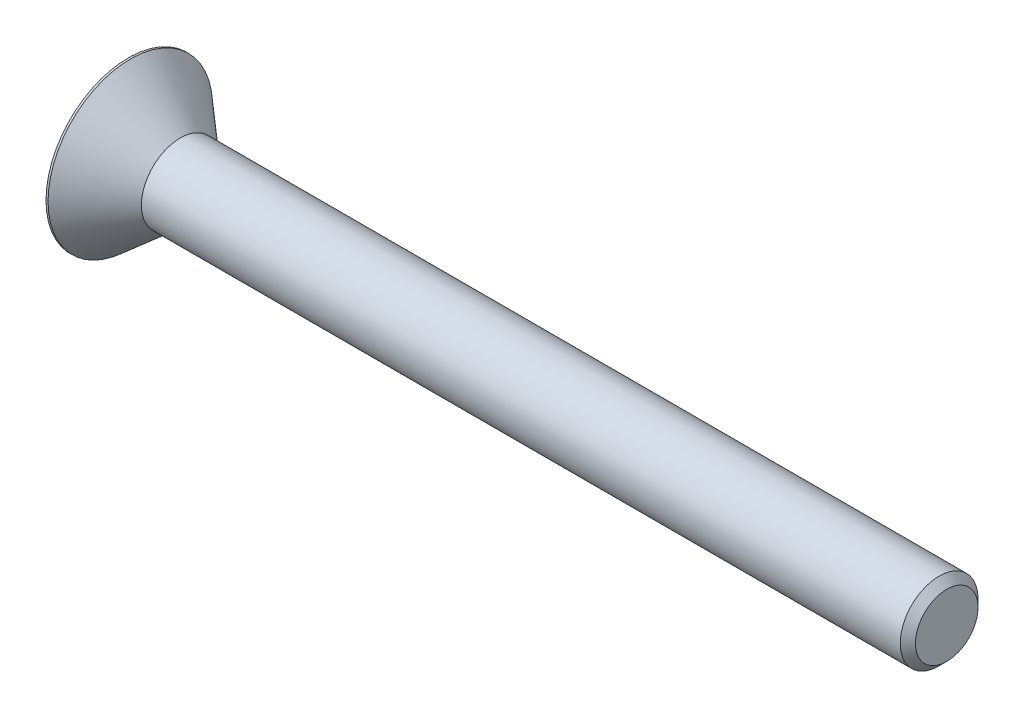
ISO-10303-21;
HEADER;
FILE_DESCRIPTION(('STEP AP214'),'2;1');
FILE_NAME('part.step','',(''),(''),'','','');
FILE_SCHEMA(('AUTOMOTIVE_DESIGN { 1 0 10303 214 1 1 1 1 }'));
ENDSEC;
DATA;
#1=APPLICATION_CONTEXT('core data for automotive mechanical design processes');
#2=APPLICATION_PROTOCOL_DEFINITION('international standard','automotive_design',2000,#1);
#3=PRODUCT_CONTEXT('',#1,'mechanical');
#4=PRODUCT('Part','Part','',(#3));
#5=PRODUCT_RELATED_PRODUCT_CATEGORY('part','',(#4));
#6=PRODUCT_DEFINITION_FORMATION('','',#4);
#7=PRODUCT_DEFINITION_CONTEXT('part definition',#1,'design');
#8=PRODUCT_DEFINITION('design','',#6,#7);
#9=PRODUCT_DEFINITION_SHAPE('','',#8);
#10=(LENGTH_UNIT() NAMED_UNIT(*) SI_UNIT(.MILLI.,.METRE.));
#11=(NAMED_UNIT(*) PLANE_ANGLE_UNIT() SI_UNIT($,.RADIAN.));
#12=(NAMED_UNIT(*) SI_UNIT($,.STERADIAN.) SOLID_ANGLE_UNIT());
#13=UNCERTAINTY_MEASURE_WITH_UNIT(LENGTH_MEASURE(1.E-05),#10,'distance_accuracy_value','');
#14=(GEOMETRIC_REPRESENTATION_CONTEXT(3) GLOBAL_UNCERTAINTY_ASSIGNED_CONTEXT((#13)) GLOBAL_UNIT_ASSIGNED_CONTEXT((#10,
#11,#12)) REPRESENTATION_CONTEXT('',''));
#15=CARTESIAN_POINT('',(0.,0.,0.));
#16=DIRECTION('',(0.,0.,1.));
#17=DIRECTION('',(1.,0.,0.));
#18=AXIS2_PLACEMENT_3D('',#15,#16,#17);
#19=CARTESIAN_POINT('',(2.20980000000282,0.,0.));
#20=DIRECTION('',(-1.,0.,0.));
#21=DIRECTION('',(0.,0.,1.));
#22=AXIS2_PLACEMENT_3D('',#19,#20,#21);
#23=CONICAL_SURFACE('',#22,1.58750000002783,1.04719755117658);
#24=CARTESIAN_POINT('',(3.12634355233854,0.,-5.6843418860808E-11));
#25=VERTEX_POINT('',#24);
#26=VERTEX_LOOP('',#25);
#27=FACE_BOUND('',#26,.T.);
#28=CARTESIAN_POINT('',(2.20980000000282,0.,0.));
#29=DIRECTION('',(-1.,0.,0.));
#30=DIRECTION('',(0.,0.,1.));
#31=AXIS2_PLACEMENT_3D('',#28,#29,#30);
#32=CIRCLE('',#31,1.58750000002783);
#33=CARTESIAN_POINT('',(2.20980000000141,0.,-1.58750000001392));
#34=VERTEX_POINT('',#33);
#35=CARTESIAN_POINT('',(2.20980000000141,1.37481532851985,-0.793750000006957));
#36=VERTEX_POINT('',#35);
#37=EDGE_CURVE('E20',#34,#36,#32,.F.);
#38=ORIENTED_EDGE('',*,*,#37,.F.);
#39=CARTESIAN_POINT('',(2.20980000000282,0.,0.));
#40=DIRECTION('',(-1.,0.,0.));
#41=DIRECTION('',(0.,0.,1.));
#42=AXIS2_PLACEMENT_3D('',#39,#40,#41);
#43=CIRCLE('',#42,1.58750000002783);
#44=CARTESIAN_POINT('',(2.20980000000141,-1.37481532851985,-0.79375000000696));
#45=VERTEX_POINT('',#44);
#46=EDGE_CURVE('E88',#45,#34,#43,.F.);
#47=ORIENTED_EDGE('',*,*,#46,.F.);
#48=CARTESIAN_POINT('',(2.20980000000282,0.,0.));
#49=DIRECTION('',(-1.,0.,0.));
#50=DIRECTION('',(0.,0.,1.));
#51=AXIS2_PLACEMENT_3D('',#48,#49,#50);
#52=CIRCLE('',#51,1.58750000002783);
#53=CARTESIAN_POINT('',(2.20980000000141,-1.37481532851985,0.79375000000696));
#54=VERTEX_POINT('',#53);
#55=EDGE_CURVE('E106',#54,#45,#52,.F.);
#56=ORIENTED_EDGE('',*,*,#55,.F.);
#57=CARTESIAN_POINT('',(2.20980000000282,0.,0.));
#58=DIRECTION('',(-1.,0.,0.));
#59=DIRECTION('',(0.,0.,1.));
#60=AXIS2_PLACEMENT_3D('',#57,#58,#59);
#61=CIRCLE('',#60,1.58750000002783);
#62=CARTESIAN_POINT('',(2.20980000000141,0.,1.58750000001392));
#63=VERTEX_POINT('',#62);
#64=EDGE_CURVE('E105',#63,#54,#61,.F.);
#65=ORIENTED_EDGE('',*,*,#64,.F.);
#66=CARTESIAN_POINT('',(2.20980000000282,0.,0.));
#67=DIRECTION('',(-1.,0.,0.));
#68=DIRECTION('',(0.,0.,1.));
#69=AXIS2_PLACEMENT_3D('',#66,#67,#68);
#70=CIRCLE('',#69,1.58750000002783);
#71=CARTESIAN_POINT('',(2.20980000000141,1.37481532851985,0.793750000006956));
#72=VERTEX_POINT('',#71);
#73=EDGE_CURVE('E168',#72,#63,#70,.F.);
#74=ORIENTED_EDGE('',*,*,#73,.F.);
#75=CARTESIAN_POINT('',(2.20980000000282,0.,0.));
#76=DIRECTION('',(-1.,0.,0.));
#77=DIRECTION('',(0.,0.,1.));
#78=AXIS2_PLACEMENT_3D('',#75,#76,#77);
#79=CIRCLE('',#78,1.58750000002783);
#80=EDGE_CURVE('E91',#36,#72,#79,.F.);
#81=ORIENTED_EDGE('',*,*,#80,.F.);
#82=EDGE_LOOP('',(#38,#47,#56,#65,#74,#81));
#83=FACE_BOUND('',#82,.T.);
#84=ADVANCED_FACE('F17',(#27,#83),#23,.F.);
#85=CARTESIAN_POINT('',(2.2098,-1.83308710467706,0.));
#86=DIRECTION('',(-1.,0.,0.));
#87=DIRECTION('',(0.,0.,1.));
#88=AXIS2_PLACEMENT_3D('',#85,#86,#87);
#89=PLANE('',#88);
#90=DIRECTION('',(0.,-0.500000000000001,0.866025403784438));
#91=VECTOR('',#90,1.);
#92=CARTESIAN_POINT('',(2.2098,-1.83308710467706,0.));
#93=LINE('',#92,#91);
#94=CARTESIAN_POINT('',(2.2098,-1.83308710467706,0.));
#95=VERTEX_POINT('',#94);
#96=EDGE_CURVE('E129',#95,#45,#93,.F.);
#97=ORIENTED_EDGE('',*,*,#96,.F.);
#98=DIRECTION('',(0.,0.500000000000002,0.866025403784438));
#99=VECTOR('',#98,1.);
#100=CARTESIAN_POINT('',(2.2098,-0.916543552338528,1.5875));
#101=LINE('',#100,#99);
#102=EDGE_CURVE('E145',#54,#95,#101,.F.);
#103=ORIENTED_EDGE('',*,*,#102,.F.);
#104=ORIENTED_EDGE('',*,*,#55,.T.);
#105=EDGE_LOOP('',(#97,#103,#104));
#106=FACE_BOUND('',#105,.T.);
#107=ADVANCED_FACE('F264',(#106),#89,.T.);
#108=CARTESIAN_POINT('',(2.2098,-1.83308710467706,0.));
#109=DIRECTION('',(-1.,0.,0.));
#110=DIRECTION('',(0.,0.,1.));
#111=AXIS2_PLACEMENT_3D('',#108,#109,#110);
#112=PLANE('',#111);
#113=DIRECTION('',(0.,1.,0.));
#114=VECTOR('',#113,1.);
#115=CARTESIAN_POINT('',(2.2098,-0.91654355233853,-1.5875));
#116=LINE('',#115,#114);
#117=CARTESIAN_POINT('',(2.2098,-0.91654355233853,-1.5875));
#118=VERTEX_POINT('',#117);
#119=EDGE_CURVE('E101',#118,#34,#116,.T.);
#120=ORIENTED_EDGE('',*,*,#119,.F.);
#121=DIRECTION('',(0.,-0.500000000000001,0.866025403784438));
#122=VECTOR('',#121,1.);
#123=CARTESIAN_POINT('',(2.2098,-1.83308710467706,0.));
#124=LINE('',#123,#122);
#125=EDGE_CURVE('E103',#45,#118,#124,.F.);
#126=ORIENTED_EDGE('',*,*,#125,.F.);
#127=ORIENTED_EDGE('',*,*,#46,.T.);
#128=EDGE_LOOP('',(#120,#126,#127));
#129=FACE_BOUND('',#128,.T.);
#130=ADVANCED_FACE('F99',(#129),#112,.T.);
#131=CARTESIAN_POINT('',(2.2098,-1.83308710467706,0.));
#132=DIRECTION('',(-1.,0.,0.));
#133=DIRECTION('',(0.,0.,1.));
#134=AXIS2_PLACEMENT_3D('',#131,#132,#133);
#135=PLANE('',#134);
#136=DIRECTION('',(0.,-0.5,-0.866025403784439));
#137=VECTOR('',#136,1.);
#138=CARTESIAN_POINT('',(2.2098,0.91654355233853,-1.5875));
#139=LINE('',#138,#137);
#140=CARTESIAN_POINT('',(2.2098,0.91654355233853,-1.5875));
#141=VERTEX_POINT('',#140);
#142=EDGE_CURVE('E110',#141,#36,#139,.F.);
#143=ORIENTED_EDGE('',*,*,#142,.F.);
#144=DIRECTION('',(0.,1.,0.));
#145=VECTOR('',#144,1.);
#146=CARTESIAN_POINT('',(2.2098,-0.91654355233853,-1.5875));
#147=LINE('',#146,#145);
#148=EDGE_CURVE('E108',#34,#141,#147,.T.);
#149=ORIENTED_EDGE('',*,*,#148,.F.);
#150=ORIENTED_EDGE('',*,*,#37,.T.);
#151=EDGE_LOOP('',(#143,#149,#150));
#152=FACE_BOUND('',#151,.T.);
#153=ADVANCED_FACE('F109',(#152),#135,.T.);
#154=CARTESIAN_POINT('',(2.2098,-1.83308710467706,0.));
#155=DIRECTION('',(-1.,0.,0.));
#156=DIRECTION('',(0.,0.,1.));
#157=AXIS2_PLACEMENT_3D('',#154,#155,#156);
#158=PLANE('',#157);
#159=DIRECTION('',(0.,0.499999999999999,-0.866025403784439));
#160=VECTOR('',#159,1.);
#161=CARTESIAN_POINT('',(2.2098,1.83308710467706,0.));
#162=LINE('',#161,#160);
#163=CARTESIAN_POINT('',(2.2098,1.83308710467706,0.));
#164=VERTEX_POINT('',#163);
#165=EDGE_CURVE('E174',#164,#72,#162,.F.);
#166=ORIENTED_EDGE('',*,*,#165,.F.);
#167=DIRECTION('',(0.,-0.5,-0.866025403784439));
#168=VECTOR('',#167,1.);
#169=CARTESIAN_POINT('',(2.2098,0.91654355233853,-1.5875));
#170=LINE('',#169,#168);
#171=EDGE_CURVE('E176',#36,#164,#170,.F.);
#172=ORIENTED_EDGE('',*,*,#171,.F.);
#173=ORIENTED_EDGE('',*,*,#80,.T.);
#174=EDGE_LOOP('',(#166,#172,#173));
#175=FACE_BOUND('',#174,.T.);
#176=ADVANCED_FACE('F173',(#175),#158,.T.);
#177=CARTESIAN_POINT('',(2.2098,-1.83308710467706,0.));
#178=DIRECTION('',(-1.,0.,0.));
#179=DIRECTION('',(0.,0.,1.));
#180=AXIS2_PLACEMENT_3D('',#177,#178,#179);
#181=PLANE('',#180);
#182=DIRECTION('',(0.,1.,0.));
#183=VECTOR('',#182,1.);
#184=CARTESIAN_POINT('',(2.2098,0.91654355233853,1.5875));
#185=LINE('',#184,#183);
#186=CARTESIAN_POINT('',(2.2098,0.91654355233853,1.5875));
#187=VERTEX_POINT('',#186);
#188=EDGE_CURVE('E187',#187,#63,#185,.F.);
#189=ORIENTED_EDGE('',*,*,#188,.F.);
#190=DIRECTION('',(0.,0.499999999999999,-0.866025403784439));
#191=VECTOR('',#190,1.);
#192=CARTESIAN_POINT('',(2.2098,1.83308710467706,0.));
#193=LINE('',#192,#191);
#194=EDGE_CURVE('E179',#72,#187,#193,.F.);
#195=ORIENTED_EDGE('',*,*,#194,.F.);
#196=ORIENTED_EDGE('',*,*,#73,.T.);
#197=EDGE_LOOP('',(#189,#195,#196));
#198=FACE_BOUND('',#197,.T.);
#199=ADVANCED_FACE('F184',(#198),#181,.T.);
#200=CARTESIAN_POINT('',(2.2098,-1.83308710467706,0.));
#201=DIRECTION('',(-1.,0.,0.));
#202=DIRECTION('',(0.,0.,1.));
#203=AXIS2_PLACEMENT_3D('',#200,#201,#202);
#204=PLANE('',#203);
#205=DIRECTION('',(0.,0.500000000000002,0.866025403784438));
#206=VECTOR('',#205,1.);
#207=CARTESIAN_POINT('',(2.2098,-0.916543552338528,1.5875));
#208=LINE('',#207,#206);
#209=CARTESIAN_POINT('',(2.2098,-0.916543552338528,1.5875));
#210=VERTEX_POINT('',#209);
#211=EDGE_CURVE('E149',#210,#54,#208,.F.);
#212=ORIENTED_EDGE('',*,*,#211,.F.);
#213=DIRECTION('',(0.,1.,0.));
#214=VECTOR('',#213,1.);
#215=CARTESIAN_POINT('',(2.2098,0.91654355233853,1.5875));
#216=LINE('',#215,#214);
#217=EDGE_CURVE('E193',#63,#210,#216,.F.);
#218=ORIENTED_EDGE('',*,*,#217,.F.);
#219=ORIENTED_EDGE('',*,*,#64,.T.);
#220=EDGE_LOOP('',(#212,#218,#219));
#221=FACE_BOUND('',#220,.T.);
#222=ADVANCED_FACE('F194',(#221),#204,.T.);
#223=CARTESIAN_POINT('',(2.2098,-0.916543552338528,1.5875));
#224=DIRECTION('',(0.,0.866025403784438,-0.500000000000002));
#225=DIRECTION('',(0.,0.500000000000002,0.866025403784438));
#226=AXIS2_PLACEMENT_3D('',#223,#224,#225);
#227=PLANE('',#226);
#228=ORIENTED_EDGE('',*,*,#102,.T.);
#229=DIRECTION('',(1.,0.,0.));
#230=VECTOR('',#229,1.);
#231=CARTESIAN_POINT('',(2.2098,-1.83308710467706,0.));
#232=LINE('',#231,#230);
#233=CARTESIAN_POINT('',(0.,-1.83308710467706,0.));
#234=VERTEX_POINT('',#233);
#235=EDGE_CURVE('E140',#234,#95,#232,.T.);
#236=ORIENTED_EDGE('',*,*,#235,.F.);
#237=DIRECTION('',(0.,-0.500000000000002,-0.866025403784438));
#238=VECTOR('',#237,1.);
#239=CARTESIAN_POINT('',(0.,-0.916543552338528,1.5875));
#240=LINE('',#239,#238);
#241=CARTESIAN_POINT('',(0.,-0.916543552338528,1.5875));
#242=VERTEX_POINT('',#241);
#243=EDGE_CURVE('E136',#242,#234,#240,.T.);
#244=ORIENTED_EDGE('',*,*,#243,.F.);
#245=DIRECTION('',(1.,0.,0.));
#246=VECTOR('',#245,1.);
#247=CARTESIAN_POINT('',(2.2098,-0.916543552338528,1.5875));
#248=LINE('',#247,#246);
#249=EDGE_CURVE('E154',#210,#242,#248,.F.);
#250=ORIENTED_EDGE('',*,*,#249,.F.);
#251=ORIENTED_EDGE('',*,*,#211,.T.);
#252=EDGE_LOOP('',(#228,#236,#244,#250,#251));
#253=FACE_BOUND('',#252,.T.);
#254=ADVANCED_FACE('F259',(#253),#227,.T.);
#255=CARTESIAN_POINT('',(2.2098,-1.83308710467706,0.));
#256=DIRECTION('',(0.,0.866025403784438,0.500000000000001));
#257=DIRECTION('',(0.,-0.500000000000001,0.866025403784438));
#258=AXIS2_PLACEMENT_3D('',#255,#256,#257);
#259=PLANE('',#258);
#260=ORIENTED_EDGE('',*,*,#125,.T.);
#261=DIRECTION('',(1.,0.,0.));
#262=VECTOR('',#261,1.);
#263=CARTESIAN_POINT('',(2.2098,-0.91654355233853,-1.5875));
#264=LINE('',#263,#262);
#265=CARTESIAN_POINT('',(0.,-0.91654355233853,-1.5875));
#266=VERTEX_POINT('',#265);
#267=EDGE_CURVE('E117',#266,#118,#264,.T.);
#268=ORIENTED_EDGE('',*,*,#267,.F.);
#269=DIRECTION('',(0.,0.500000000000001,-0.866025403784438));
#270=VECTOR('',#269,1.);
#271=CARTESIAN_POINT('',(0.,-1.83308710467706,0.));
#272=LINE('',#271,#270);
#273=EDGE_CURVE('E132',#234,#266,#272,.T.);
#274=ORIENTED_EDGE('',*,*,#273,.F.);
#275=ORIENTED_EDGE('',*,*,#235,.T.);
#276=ORIENTED_EDGE('',*,*,#96,.T.);
#277=EDGE_LOOP('',(#260,#268,#274,#275,#276));
#278=FACE_BOUND('',#277,.T.);
#279=ADVANCED_FACE('F262',(#278),#259,.T.);
#280=CARTESIAN_POINT('',(2.2098,-0.91654355233853,-1.5875));
#281=DIRECTION('',(0.,0.,1.));
#282=DIRECTION('',(1.,0.,0.));
#283=AXIS2_PLACEMENT_3D('',#280,#281,#282);
#284=PLANE('',#283);
#285=ORIENTED_EDGE('',*,*,#148,.T.);
#286=DIRECTION('',(1.,0.,0.));
#287=VECTOR('',#286,1.);
#288=CARTESIAN_POINT('',(2.2098,0.91654355233853,-1.5875));
#289=LINE('',#288,#287);
#290=CARTESIAN_POINT('',(0.,0.91654355233853,-1.5875));
#291=VERTEX_POINT('',#290);
#292=EDGE_CURVE('E113',#291,#141,#289,.T.);
#293=ORIENTED_EDGE('',*,*,#292,.F.);
#294=DIRECTION('',(0.,1.,0.));
#295=VECTOR('',#294,1.);
#296=CARTESIAN_POINT('',(0.,0.,-1.5875));
#297=LINE('',#296,#295);
#298=EDGE_CURVE('E135',#266,#291,#297,.T.);
#299=ORIENTED_EDGE('',*,*,#298,.F.);
#300=ORIENTED_EDGE('',*,*,#267,.T.);
#301=ORIENTED_EDGE('',*,*,#119,.T.);
#302=EDGE_LOOP('',(#285,#293,#299,#300,#301));
#303=FACE_BOUND('',#302,.T.);
#304=ADVANCED_FACE('F115',(#303),#284,.T.);
#305=CARTESIAN_POINT('',(2.2098,0.91654355233853,-1.5875));
#306=DIRECTION('',(0.,-0.866025403784439,0.5));
#307=DIRECTION('',(0.,-0.5,-0.866025403784439));
#308=AXIS2_PLACEMENT_3D('',#305,#306,#307);
#309=PLANE('',#308);
#310=ORIENTED_EDGE('',*,*,#171,.T.);
#311=DIRECTION('',(1.,0.,0.));
#312=VECTOR('',#311,1.);
#313=CARTESIAN_POINT('',(2.2098,1.83308710467706,0.));
#314=LINE('',#313,#312);
#315=CARTESIAN_POINT('',(0.,1.83308710467706,0.));
#316=VERTEX_POINT('',#315);
#317=EDGE_CURVE('E181',#316,#164,#314,.T.);
#318=ORIENTED_EDGE('',*,*,#317,.F.);
#319=DIRECTION('',(0.,0.5,0.866025403784439));
#320=VECTOR('',#319,1.);
#321=CARTESIAN_POINT('',(0.,0.91654355233853,-1.5875));
#322=LINE('',#321,#320);
#323=EDGE_CURVE('E227',#291,#316,#322,.T.);
#324=ORIENTED_EDGE('',*,*,#323,.F.);
#325=ORIENTED_EDGE('',*,*,#292,.T.);
#326=ORIENTED_EDGE('',*,*,#142,.T.);
#327=EDGE_LOOP('',(#310,#318,#324,#325,#326));
#328=FACE_BOUND('',#327,.T.);
#329=ADVANCED_FACE('F256',(#328),#309,.T.);
#330=CARTESIAN_POINT('',(2.2098,1.83308710467706,0.));
#331=DIRECTION('',(0.,-0.866025403784439,-0.499999999999999));
#332=DIRECTION('',(0.,0.499999999999999,-0.866025403784439));
#333=AXIS2_PLACEMENT_3D('',#330,#331,#332);
#334=PLANE('',#333);
#335=ORIENTED_EDGE('',*,*,#194,.T.);
#336=DIRECTION('',(1.,0.,0.));
#337=VECTOR('',#336,1.);
#338=CARTESIAN_POINT('',(2.2098,0.91654355233853,1.5875));
#339=LINE('',#338,#337);
#340=CARTESIAN_POINT('',(0.,0.91654355233853,1.5875));
#341=VERTEX_POINT('',#340);
#342=EDGE_CURVE('E35',#341,#187,#339,.T.);
#343=ORIENTED_EDGE('',*,*,#342,.F.);
#344=DIRECTION('',(0.,-0.499999999999999,0.866025403784439));
#345=VECTOR('',#344,1.);
#346=CARTESIAN_POINT('',(0.,1.83308710467706,0.));
#347=LINE('',#346,#345);
#348=EDGE_CURVE('E222',#316,#341,#347,.T.);
#349=ORIENTED_EDGE('',*,*,#348,.F.);
#350=ORIENTED_EDGE('',*,*,#317,.T.);
#351=ORIENTED_EDGE('',*,*,#165,.T.);
#352=EDGE_LOOP('',(#335,#343,#349,#350,#351));
#353=FACE_BOUND('',#352,.T.);
#354=ADVANCED_FACE('F178',(#353),#334,.T.);
#355=CARTESIAN_POINT('',(2.2098,0.91654355233853,1.5875));
#356=DIRECTION('',(0.,0.,-1.));
#357=DIRECTION('',(0.,1.,0.));
#358=AXIS2_PLACEMENT_3D('',#355,#356,#357);
#359=PLANE('',#358);
#360=ORIENTED_EDGE('',*,*,#217,.T.);
#361=ORIENTED_EDGE('',*,*,#249,.T.);
#362=DIRECTION('',(0.,1.,0.));
#363=VECTOR('',#362,1.);
#364=CARTESIAN_POINT('',(0.,0.,1.5875));
#365=LINE('',#364,#363);
#366=EDGE_CURVE('E164',#341,#242,#365,.F.);
#367=ORIENTED_EDGE('',*,*,#366,.F.);
#368=ORIENTED_EDGE('',*,*,#342,.T.);
#369=ORIENTED_EDGE('',*,*,#188,.T.);
#370=EDGE_LOOP('',(#360,#361,#367,#368,#369));
#371=FACE_BOUND('',#370,.T.);
#372=ADVANCED_FACE('F200',(#371),#359,.T.);
#373=CARTESIAN_POINT('',(0.,0.,0.));
#374=DIRECTION('',(-1.,0.,0.));
#375=DIRECTION('',(0.,0.,1.));
#376=AXIS2_PLACEMENT_3D('',#373,#374,#375);
#377=PLANE('',#376);
#378=ORIENTED_EDGE('',*,*,#348,.T.);
#379=ORIENTED_EDGE('',*,*,#366,.T.);
#380=ORIENTED_EDGE('',*,*,#243,.T.);
#381=ORIENTED_EDGE('',*,*,#273,.T.);
#382=ORIENTED_EDGE('',*,*,#298,.T.);
#383=ORIENTED_EDGE('',*,*,#323,.T.);
#384=EDGE_LOOP('',(#378,#379,#380,#381,#382,#383));
#385=FACE_BOUND('',#384,.T.);
#386=CARTESIAN_POINT('',(0.,0.,0.));
#387=DIRECTION('',(-1.,0.,0.));
#388=DIRECTION('',(0.,0.,1.));
#389=AXIS2_PLACEMENT_3D('',#386,#387,#388);
#390=CIRCLE('',#389,5.10667);
#391=CARTESIAN_POINT('',(0.,0.,5.10667));
#392=VERTEX_POINT('',#391);
#393=EDGE_CURVE('E161',#392,#392,#390,.F.);
#394=ORIENTED_EDGE('',*,*,#393,.F.);
#395=EDGE_LOOP('',(#394));
#396=FACE_BOUND('',#395,.T.);
#397=ADVANCED_FACE('F251',(#385,#396),#377,.T.);
#398=CARTESIAN_POINT('',(50.8,1.94056,0.));
#399=DIRECTION('',(1.,0.,0.));
#400=DIRECTION('',(0.,0.,-1.));
#401=AXIS2_PLACEMENT_3D('',#398,#399,#400);
#402=PLANE('',#401);
#403=CARTESIAN_POINT('',(50.7999999999811,0.,0.));
#404=DIRECTION('',(-1.,0.,0.));
#405=DIRECTION('',(0.,0.,1.));
#406=AXIS2_PLACEMENT_3D('',#403,#404,#405);
#407=CIRCLE('',#406,1.94055999998);
#408=CARTESIAN_POINT('',(50.7999999999811,0.,1.94055999998));
#409=VERTEX_POINT('',#408);
#410=EDGE_CURVE('E157',#409,#409,#407,.T.);
#411=ORIENTED_EDGE('',*,*,#410,.F.);
#412=EDGE_LOOP('',(#411));
#413=FACE_BOUND('',#412,.T.);
#414=ADVANCED_FACE('F292',(#413),#402,.T.);
#415=CARTESIAN_POINT('',(0.,0.,0.));
#416=DIRECTION('',(-1.,0.,0.));
#417=DIRECTION('',(0.,0.,1.));
#418=AXIS2_PLACEMENT_3D('',#415,#416,#417);
#419=CYLINDRICAL_SURFACE('',#418,5.10667);
#420=ORIENTED_EDGE('',*,*,#393,.T.);
#421=EDGE_LOOP('',(#420));
#422=FACE_BOUND('',#421,.T.);
#423=CARTESIAN_POINT('',(0.127000000020416,0.,0.));
#424=DIRECTION('',(-1.,0.,0.));
#425=DIRECTION('',(0.,0.,1.));
#426=AXIS2_PLACEMENT_3D('',#423,#424,#425);
#427=CIRCLE('',#426,5.10666999997511);
#428=CARTESIAN_POINT('',(0.127000000020416,0.,5.10666999997511));
#429=VERTEX_POINT('',#428);
#430=EDGE_CURVE('E160',#429,#429,#427,.F.);
#431=ORIENTED_EDGE('',*,*,#430,.F.);
#432=EDGE_LOOP('',(#431));
#433=FACE_BOUND('',#432,.T.);
#434=ADVANCED_FACE('F288',(#422,#433),#419,.T.);
#435=CARTESIAN_POINT('',(50.3275600000279,0.,0.));
#436=DIRECTION('',(-1.,0.,0.));
#437=DIRECTION('',(0.,0.,1.));
#438=AXIS2_PLACEMENT_3D('',#435,#436,#437);
#439=CONICAL_SURFACE('',#438,2.41299999993316,0.785398163397448);
#440=CARTESIAN_POINT('',(50.32756,0.,0.));
#441=DIRECTION('',(-1.,0.,0.));
#442=DIRECTION('',(0.,0.,1.));
#443=AXIS2_PLACEMENT_3D('',#440,#441,#442);
#444=CIRCLE('',#443,2.41299999999999);
#445=CARTESIAN_POINT('',(50.32756,0.,2.41299999999999));
#446=VERTEX_POINT('',#445);
#447=EDGE_CURVE('E26',#446,#446,#444,.T.);
#448=ORIENTED_EDGE('',*,*,#447,.F.);
#449=EDGE_LOOP('',(#448));
#450=FACE_BOUND('',#449,.T.);
#451=ORIENTED_EDGE('',*,*,#410,.T.);
#452=EDGE_LOOP('',(#451));
#453=FACE_BOUND('',#452,.T.);
#454=ADVANCED_FACE('F281',(#450,#453),#439,.T.);
#455=CARTESIAN_POINT('',(0.127000000020416,0.,0.));
#456=DIRECTION('',(-1.,0.,0.));
#457=DIRECTION('',(0.,0.,1.));
#458=AXIS2_PLACEMENT_3D('',#455,#456,#457);
#459=CONICAL_SURFACE('',#458,5.10666999997511,0.715584993312814);
#460=ORIENTED_EDGE('',*,*,#430,.T.);
#461=EDGE_LOOP('',(#460));
#462=FACE_BOUND('',#461,.T.);
#463=CARTESIAN_POINT('',(3.22571286747901,0.,0.));
#464=DIRECTION('',(-1.,0.,0.));
#465=DIRECTION('',(0.,0.,1.));
#466=AXIS2_PLACEMENT_3D('',#463,#464,#465);
#467=CIRCLE('',#466,2.41299999999999);
#468=CARTESIAN_POINT('',(3.22571286747901,0.,2.41299999999999));
#469=VERTEX_POINT('',#468);
#470=EDGE_CURVE('E11',#469,#469,#467,.F.);
#471=ORIENTED_EDGE('',*,*,#470,.F.);
#472=EDGE_LOOP('',(#471));
#473=FACE_BOUND('',#472,.T.);
#474=ADVANCED_FACE('F275',(#462,#473),#459,.T.);
#475=CARTESIAN_POINT('',(0.,0.,0.));
#476=DIRECTION('',(-1.,0.,0.));
#477=DIRECTION('',(0.,0.,1.));
#478=AXIS2_PLACEMENT_3D('',#475,#476,#477);
#479=CYLINDRICAL_SURFACE('',#478,2.41299999999999);
#480=ORIENTED_EDGE('',*,*,#470,.T.);
#481=EDGE_LOOP('',(#480));
#482=FACE_BOUND('',#481,.T.);
#483=ORIENTED_EDGE('',*,*,#447,.T.);
#484=EDGE_LOOP('',(#483));
#485=FACE_BOUND('',#484,.T.);
#486=ADVANCED_FACE('F273',(#482,#485),#479,.T.);
#487=CLOSED_SHELL('',(#84,#107,#130,#153,#176,#199,#222,#254,#279,#304,#329,#354,#372,#397,#414,
#434,#454,#474,#486));
#488=MANIFOLD_SOLID_BREP('B1',#487);
#489=ADVANCED_BREP_SHAPE_REPRESENTATION('',(#18,#488),#14);
#490=SHAPE_DEFINITION_REPRESENTATION(#9,#489);
ENDSEC;
END-ISO-10303-21;
